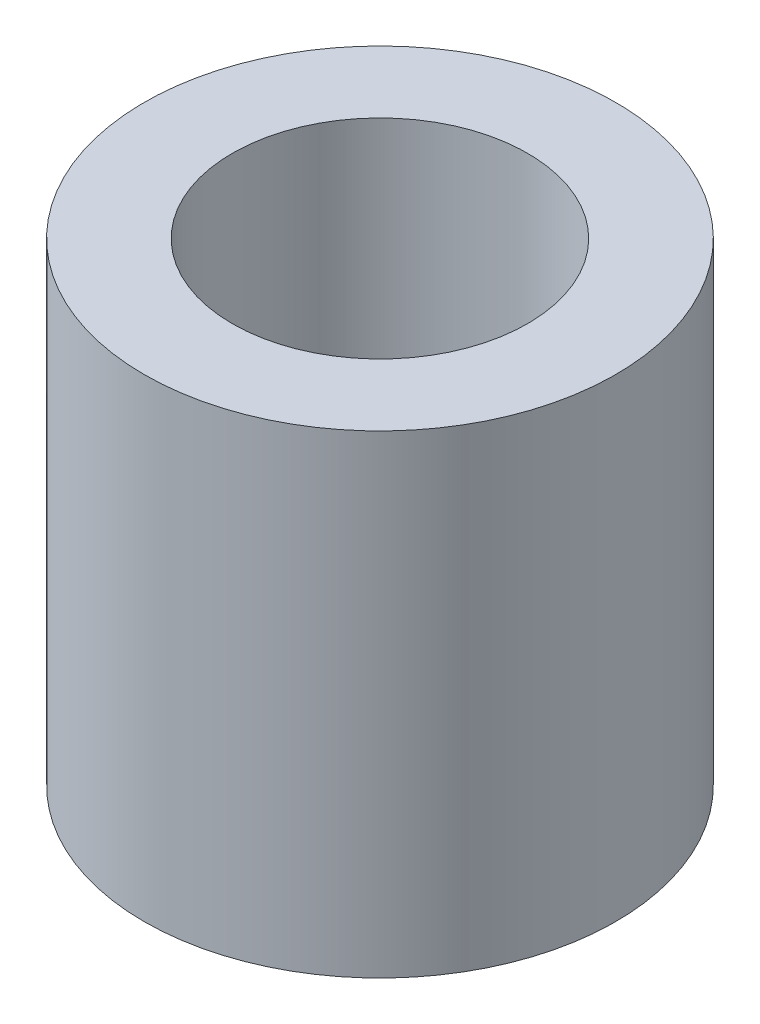
ISO-10303-21;
HEADER;
FILE_DESCRIPTION(('STEP AP214'),'2;1');
FILE_NAME('part.step','',(''),(''),'','','');
FILE_SCHEMA(('AUTOMOTIVE_DESIGN { 1 0 10303 214 1 1 1 1 }'));
ENDSEC;
DATA;
#1=APPLICATION_CONTEXT('core data for automotive mechanical design processes');
#2=APPLICATION_PROTOCOL_DEFINITION('international standard','automotive_design',2000,#1);
#3=PRODUCT_CONTEXT('',#1,'mechanical');
#4=PRODUCT('Part','Part','',(#3));
#5=PRODUCT_RELATED_PRODUCT_CATEGORY('part','',(#4));
#6=PRODUCT_DEFINITION_FORMATION('','',#4);
#7=PRODUCT_DEFINITION_CONTEXT('part definition',#1,'design');
#8=PRODUCT_DEFINITION('design','',#6,#7);
#9=PRODUCT_DEFINITION_SHAPE('','',#8);
#10=(LENGTH_UNIT() NAMED_UNIT(*) SI_UNIT(.MILLI.,.METRE.));
#11=(NAMED_UNIT(*) PLANE_ANGLE_UNIT() SI_UNIT($,.RADIAN.));
#12=(NAMED_UNIT(*) SI_UNIT($,.STERADIAN.) SOLID_ANGLE_UNIT());
#13=UNCERTAINTY_MEASURE_WITH_UNIT(LENGTH_MEASURE(1.E-05),#10,'distance_accuracy_value','');
#14=(GEOMETRIC_REPRESENTATION_CONTEXT(3) GLOBAL_UNCERTAINTY_ASSIGNED_CONTEXT((#13)) GLOBAL_UNIT_ASSIGNED_CONTEXT((#10,
#11,#12)) REPRESENTATION_CONTEXT('',''));
#15=CARTESIAN_POINT('',(0.,0.,0.));
#16=DIRECTION('',(0.,0.,1.));
#17=DIRECTION('',(1.,0.,0.));
#18=AXIS2_PLACEMENT_3D('',#15,#16,#17);
#19=CARTESIAN_POINT('',(0.,25.1241397303429,0.));
#20=DIRECTION('',(0.,-1.,0.));
#21=DIRECTION('',(0.,0.,-1.));
#22=AXIS2_PLACEMENT_3D('',#19,#20,#21);
#23=CYLINDRICAL_SURFACE('',#22,12.5);
#24=CARTESIAN_POINT('',(0.,25.1241397303429,0.));
#25=DIRECTION('',(0.,1.,0.));
#26=DIRECTION('',(0.,0.,1.));
#27=AXIS2_PLACEMENT_3D('',#24,#25,#26);
#28=CIRCLE('',#27,12.5);
#29=CARTESIAN_POINT('',(0.,25.1241397303429,12.5));
#30=VERTEX_POINT('',#29);
#31=EDGE_CURVE('E10',#30,#30,#28,.T.);
#32=ORIENTED_EDGE('',*,*,#31,.F.);
#33=EDGE_LOOP('',(#32));
#34=FACE_BOUND('',#33,.T.);
#35=CARTESIAN_POINT('',(0.,0.,0.));
#36=DIRECTION('',(0.,1.,0.));
#37=DIRECTION('',(0.,0.,1.));
#38=AXIS2_PLACEMENT_3D('',#35,#36,#37);
#39=CIRCLE('',#38,12.5);
#40=CARTESIAN_POINT('',(0.,0.,12.5));
#41=VERTEX_POINT('',#40);
#42=EDGE_CURVE('E37',#41,#41,#39,.T.);
#43=ORIENTED_EDGE('',*,*,#42,.T.);
#44=EDGE_LOOP('',(#43));
#45=FACE_BOUND('',#44,.T.);
#46=ADVANCED_FACE('F40',(#34,#45),#23,.T.);
#47=CARTESIAN_POINT('',(0.,25.1241397303429,0.));
#48=DIRECTION('',(0.,1.,0.));
#49=DIRECTION('',(0.,0.,1.));
#50=AXIS2_PLACEMENT_3D('',#47,#48,#49);
#51=PLANE('',#50);
#52=CARTESIAN_POINT('',(0.,25.1241397303429,0.));
#53=DIRECTION('',(0.,1.,0.));
#54=DIRECTION('',(0.,0.,1.));
#55=AXIS2_PLACEMENT_3D('',#52,#53,#54);
#56=CIRCLE('',#55,7.8282340026781);
#57=CARTESIAN_POINT('',(0.,25.1241397303429,7.8282340026781));
#58=VERTEX_POINT('',#57);
#59=EDGE_CURVE('E50',#58,#58,#56,.T.);
#60=ORIENTED_EDGE('',*,*,#59,.F.);
#61=EDGE_LOOP('',(#60));
#62=FACE_BOUND('',#61,.T.);
#63=ORIENTED_EDGE('',*,*,#31,.T.);
#64=EDGE_LOOP('',(#63));
#65=FACE_BOUND('',#64,.T.);
#66=ADVANCED_FACE('F59',(#62,#65),#51,.T.);
#67=CARTESIAN_POINT('',(0.,0.,0.));
#68=DIRECTION('',(0.,1.,0.));
#69=DIRECTION('',(0.,0.,1.));
#70=AXIS2_PLACEMENT_3D('',#67,#68,#69);
#71=PLANE('',#70);
#72=CARTESIAN_POINT('',(0.,0.,0.));
#73=DIRECTION('',(0.,1.,0.));
#74=DIRECTION('',(0.,0.,1.));
#75=AXIS2_PLACEMENT_3D('',#72,#73,#74);
#76=CIRCLE('',#75,7.8282340026781);
#77=CARTESIAN_POINT('',(0.,0.,7.8282340026781));
#78=VERTEX_POINT('',#77);
#79=EDGE_CURVE('E47',#78,#78,#76,.T.);
#80=ORIENTED_EDGE('',*,*,#79,.T.);
#81=EDGE_LOOP('',(#80));
#82=FACE_BOUND('',#81,.T.);
#83=ORIENTED_EDGE('',*,*,#42,.F.);
#84=EDGE_LOOP('',(#83));
#85=FACE_BOUND('',#84,.T.);
#86=ADVANCED_FACE('F58',(#82,#85),#71,.F.);
#87=CARTESIAN_POINT('',(0.,25.1241397303429,0.));
#88=DIRECTION('',(0.,-1.,0.));
#89=DIRECTION('',(0.,0.,-1.));
#90=AXIS2_PLACEMENT_3D('',#87,#88,#89);
#91=CYLINDRICAL_SURFACE('',#90,7.8282340026781);
#92=ORIENTED_EDGE('',*,*,#59,.T.);
#93=EDGE_LOOP('',(#92));
#94=FACE_BOUND('',#93,.T.);
#95=ORIENTED_EDGE('',*,*,#79,.F.);
#96=EDGE_LOOP('',(#95));
#97=FACE_BOUND('',#96,.T.);
#98=ADVANCED_FACE('F54',(#94,#97),#91,.F.);
#99=CLOSED_SHELL('',(#46,#66,#86,#98));
#100=MANIFOLD_SOLID_BREP('B2',#99);
#101=ADVANCED_BREP_SHAPE_REPRESENTATION('',(#18,#100),#14);
#102=SHAPE_DEFINITION_REPRESENTATION(#9,#101);
ENDSEC;
END-ISO-10303-21;
